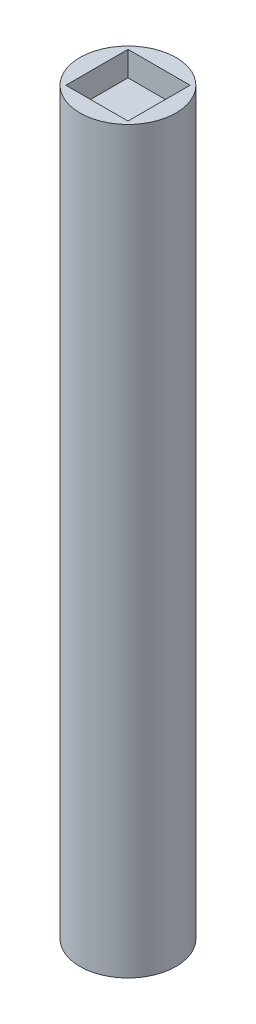
ISO-10303-21;
HEADER;
FILE_DESCRIPTION(('STEP AP214'),'2;1');
FILE_NAME('part.step','',(''),(''),'','','');
FILE_SCHEMA(('AUTOMOTIVE_DESIGN { 1 0 10303 214 1 1 1 1 }'));
ENDSEC;
DATA;
#1=APPLICATION_CONTEXT('core data for automotive mechanical design processes');
#2=APPLICATION_PROTOCOL_DEFINITION('international standard','automotive_design',2000,#1);
#3=PRODUCT_CONTEXT('',#1,'mechanical');
#4=PRODUCT('Part','Part','',(#3));
#5=PRODUCT_RELATED_PRODUCT_CATEGORY('part','',(#4));
#6=PRODUCT_DEFINITION_FORMATION('','',#4);
#7=PRODUCT_DEFINITION_CONTEXT('part definition',#1,'design');
#8=PRODUCT_DEFINITION('design','',#6,#7);
#9=PRODUCT_DEFINITION_SHAPE('','',#8);
#10=(LENGTH_UNIT() NAMED_UNIT(*) SI_UNIT(.MILLI.,.METRE.));
#11=(NAMED_UNIT(*) PLANE_ANGLE_UNIT() SI_UNIT($,.RADIAN.));
#12=(NAMED_UNIT(*) SI_UNIT($,.STERADIAN.) SOLID_ANGLE_UNIT());
#13=UNCERTAINTY_MEASURE_WITH_UNIT(LENGTH_MEASURE(1.E-05),#10,'distance_accuracy_value','');
#14=(GEOMETRIC_REPRESENTATION_CONTEXT(3) GLOBAL_UNCERTAINTY_ASSIGNED_CONTEXT((#13)) GLOBAL_UNIT_ASSIGNED_CONTEXT((#10,
#11,#12)) REPRESENTATION_CONTEXT('',''));
#15=CARTESIAN_POINT('',(0.,0.,0.));
#16=DIRECTION('',(0.,0.,1.));
#17=DIRECTION('',(1.,0.,0.));
#18=AXIS2_PLACEMENT_3D('',#15,#16,#17);
#19=CARTESIAN_POINT('',(0.,37.5,0.));
#20=DIRECTION('',(0.,-1.,0.));
#21=DIRECTION('',(0.,0.,-1.));
#22=AXIS2_PLACEMENT_3D('',#19,#20,#21);
#23=CYLINDRICAL_SURFACE('',#22,4.875);
#24=CARTESIAN_POINT('',(0.,37.5,0.));
#25=DIRECTION('',(0.,1.,0.));
#26=DIRECTION('',(0.,0.,1.));
#27=AXIS2_PLACEMENT_3D('',#24,#25,#26);
#28=CIRCLE('',#27,4.875);
#29=CARTESIAN_POINT('',(0.,37.5,4.875));
#30=VERTEX_POINT('',#29);
#31=EDGE_CURVE('E11',#30,#30,#28,.T.);
#32=ORIENTED_EDGE('',*,*,#31,.F.);
#33=EDGE_LOOP('',(#32));
#34=FACE_BOUND('',#33,.T.);
#35=CARTESIAN_POINT('',(0.,-37.5,0.));
#36=DIRECTION('',(0.,1.,0.));
#37=DIRECTION('',(0.,0.,1.));
#38=AXIS2_PLACEMENT_3D('',#35,#36,#37);
#39=CIRCLE('',#38,4.875);
#40=CARTESIAN_POINT('',(0.,-37.5,4.875));
#41=VERTEX_POINT('',#40);
#42=EDGE_CURVE('E42',#41,#41,#39,.T.);
#43=ORIENTED_EDGE('',*,*,#42,.T.);
#44=EDGE_LOOP('',(#43));
#45=FACE_BOUND('',#44,.T.);
#46=ADVANCED_FACE('F39',(#34,#45),#23,.T.);
#47=CARTESIAN_POINT('',(0.,37.5,0.));
#48=DIRECTION('',(0.,1.,0.));
#49=DIRECTION('',(0.,0.,1.));
#50=AXIS2_PLACEMENT_3D('',#47,#48,#49);
#51=PLANE('',#50);
#52=DIRECTION('',(0.,0.,1.));
#53=VECTOR('',#52,1.);
#54=CARTESIAN_POINT('',(-3.15,37.5,3.15));
#55=LINE('',#54,#53);
#56=CARTESIAN_POINT('',(-3.15,37.5,-3.15));
#57=VERTEX_POINT('',#56);
#58=CARTESIAN_POINT('',(-3.15,37.5,3.15));
#59=VERTEX_POINT('',#58);
#60=EDGE_CURVE('E106',#57,#59,#55,.T.);
#61=ORIENTED_EDGE('',*,*,#60,.F.);
#62=DIRECTION('',(-1.,0.,0.));
#63=VECTOR('',#62,1.);
#64=CARTESIAN_POINT('',(-3.15,37.5,-3.15));
#65=LINE('',#64,#63);
#66=CARTESIAN_POINT('',(3.15,37.5,-3.15));
#67=VERTEX_POINT('',#66);
#68=EDGE_CURVE('E84',#67,#57,#65,.T.);
#69=ORIENTED_EDGE('',*,*,#68,.F.);
#70=DIRECTION('',(0.,0.,-1.));
#71=VECTOR('',#70,1.);
#72=CARTESIAN_POINT('',(3.15,37.5,3.15));
#73=LINE('',#72,#71);
#74=CARTESIAN_POINT('',(3.15,37.5,3.15));
#75=VERTEX_POINT('',#74);
#76=EDGE_CURVE('E61',#75,#67,#73,.T.);
#77=ORIENTED_EDGE('',*,*,#76,.F.);
#78=DIRECTION('',(1.,0.,0.));
#79=VECTOR('',#78,1.);
#80=CARTESIAN_POINT('',(-3.15,37.5,3.15));
#81=LINE('',#80,#79);
#82=EDGE_CURVE('E111',#59,#75,#81,.T.);
#83=ORIENTED_EDGE('',*,*,#82,.F.);
#84=EDGE_LOOP('',(#61,#69,#77,#83));
#85=FACE_BOUND('',#84,.T.);
#86=ORIENTED_EDGE('',*,*,#31,.T.);
#87=EDGE_LOOP('',(#86));
#88=FACE_BOUND('',#87,.T.);
#89=ADVANCED_FACE('F120',(#85,#88),#51,.T.);
#90=CARTESIAN_POINT('',(0.,-37.5,0.));
#91=DIRECTION('',(0.,1.,0.));
#92=DIRECTION('',(0.,0.,1.));
#93=AXIS2_PLACEMENT_3D('',#90,#91,#92);
#94=PLANE('',#93);
#95=ORIENTED_EDGE('',*,*,#42,.F.);
#96=EDGE_LOOP('',(#95));
#97=FACE_BOUND('',#96,.T.);
#98=ADVANCED_FACE('F118',(#97),#94,.F.);
#99=CARTESIAN_POINT('',(3.15,35.,-3.15));
#100=DIRECTION('',(0.,0.,-1.));
#101=DIRECTION('',(-1.,0.,0.));
#102=AXIS2_PLACEMENT_3D('',#99,#100,#101);
#103=PLANE('',#102);
#104=ORIENTED_EDGE('',*,*,#68,.T.);
#105=DIRECTION('',(0.,1.,0.));
#106=VECTOR('',#105,1.);
#107=CARTESIAN_POINT('',(-3.15,35.,-3.15));
#108=LINE('',#107,#106);
#109=CARTESIAN_POINT('',(-3.15,35.,-3.15));
#110=VERTEX_POINT('',#109);
#111=EDGE_CURVE('E53',#110,#57,#108,.T.);
#112=ORIENTED_EDGE('',*,*,#111,.F.);
#113=DIRECTION('',(-1.,0.,0.));
#114=VECTOR('',#113,1.);
#115=CARTESIAN_POINT('',(3.15,35.,-3.15));
#116=LINE('',#115,#114);
#117=CARTESIAN_POINT('',(3.15,35.,-3.15));
#118=VERTEX_POINT('',#117);
#119=EDGE_CURVE('E81',#118,#110,#116,.T.);
#120=ORIENTED_EDGE('',*,*,#119,.F.);
#121=DIRECTION('',(0.,1.,0.));
#122=VECTOR('',#121,1.);
#123=CARTESIAN_POINT('',(3.15,35.,-3.15));
#124=LINE('',#123,#122);
#125=EDGE_CURVE('E104',#118,#67,#124,.T.);
#126=ORIENTED_EDGE('',*,*,#125,.T.);
#127=EDGE_LOOP('',(#104,#112,#120,#126));
#128=FACE_BOUND('',#127,.T.);
#129=ADVANCED_FACE('F79',(#128),#103,.F.);
#130=CARTESIAN_POINT('',(3.15,35.,3.15));
#131=DIRECTION('',(1.,0.,0.));
#132=DIRECTION('',(0.,0.,-1.));
#133=AXIS2_PLACEMENT_3D('',#130,#131,#132);
#134=PLANE('',#133);
#135=ORIENTED_EDGE('',*,*,#76,.T.);
#136=ORIENTED_EDGE('',*,*,#125,.F.);
#137=DIRECTION('',(0.,0.,-1.));
#138=VECTOR('',#137,1.);
#139=CARTESIAN_POINT('',(3.15,35.,3.15));
#140=LINE('',#139,#138);
#141=CARTESIAN_POINT('',(3.15,35.,3.15));
#142=VERTEX_POINT('',#141);
#143=EDGE_CURVE('E87',#142,#118,#140,.T.);
#144=ORIENTED_EDGE('',*,*,#143,.F.);
#145=DIRECTION('',(0.,1.,0.));
#146=VECTOR('',#145,1.);
#147=CARTESIAN_POINT('',(3.15,35.,3.15));
#148=LINE('',#147,#146);
#149=EDGE_CURVE('E107',#142,#75,#148,.T.);
#150=ORIENTED_EDGE('',*,*,#149,.T.);
#151=EDGE_LOOP('',(#135,#136,#144,#150));
#152=FACE_BOUND('',#151,.T.);
#153=ADVANCED_FACE('F126',(#152),#134,.F.);
#154=CARTESIAN_POINT('',(-3.15,35.,3.15));
#155=DIRECTION('',(0.,0.,1.));
#156=DIRECTION('',(1.,0.,0.));
#157=AXIS2_PLACEMENT_3D('',#154,#155,#156);
#158=PLANE('',#157);
#159=ORIENTED_EDGE('',*,*,#82,.T.);
#160=ORIENTED_EDGE('',*,*,#149,.F.);
#161=DIRECTION('',(1.,0.,0.));
#162=VECTOR('',#161,1.);
#163=CARTESIAN_POINT('',(-3.15,35.,3.15));
#164=LINE('',#163,#162);
#165=CARTESIAN_POINT('',(-3.15,35.,3.15));
#166=VERTEX_POINT('',#165);
#167=EDGE_CURVE('E96',#166,#142,#164,.T.);
#168=ORIENTED_EDGE('',*,*,#167,.F.);
#169=DIRECTION('',(0.,1.,0.));
#170=VECTOR('',#169,1.);
#171=CARTESIAN_POINT('',(-3.15,35.,3.15));
#172=LINE('',#171,#170);
#173=EDGE_CURVE('E86',#166,#59,#172,.T.);
#174=ORIENTED_EDGE('',*,*,#173,.T.);
#175=EDGE_LOOP('',(#159,#160,#168,#174));
#176=FACE_BOUND('',#175,.T.);
#177=ADVANCED_FACE('F161',(#176),#158,.F.);
#178=CARTESIAN_POINT('',(-3.15,35.,-3.15));
#179=DIRECTION('',(-1.,0.,0.));
#180=DIRECTION('',(0.,0.,1.));
#181=AXIS2_PLACEMENT_3D('',#178,#179,#180);
#182=PLANE('',#181);
#183=ORIENTED_EDGE('',*,*,#60,.T.);
#184=ORIENTED_EDGE('',*,*,#173,.F.);
#185=DIRECTION('',(0.,0.,1.));
#186=VECTOR('',#185,1.);
#187=CARTESIAN_POINT('',(-3.15,35.,-3.15));
#188=LINE('',#187,#186);
#189=EDGE_CURVE('E90',#110,#166,#188,.T.);
#190=ORIENTED_EDGE('',*,*,#189,.F.);
#191=ORIENTED_EDGE('',*,*,#111,.T.);
#192=EDGE_LOOP('',(#183,#184,#190,#191));
#193=FACE_BOUND('',#192,.T.);
#194=ADVANCED_FACE('F91',(#193),#182,.F.);
#195=CARTESIAN_POINT('',(0.,35.,0.));
#196=DIRECTION('',(0.,1.,0.));
#197=DIRECTION('',(0.,0.,1.));
#198=AXIS2_PLACEMENT_3D('',#195,#196,#197);
#199=PLANE('',#198);
#200=ORIENTED_EDGE('',*,*,#119,.T.);
#201=ORIENTED_EDGE('',*,*,#189,.T.);
#202=ORIENTED_EDGE('',*,*,#167,.T.);
#203=ORIENTED_EDGE('',*,*,#143,.T.);
#204=EDGE_LOOP('',(#200,#201,#202,#203));
#205=FACE_BOUND('',#204,.T.);
#206=ADVANCED_FACE('F98',(#205),#199,.T.);
#207=CLOSED_SHELL('',(#46,#89,#98,#129,#153,#177,#194,#206));
#208=MANIFOLD_SOLID_BREP('B2',#207);
#209=ADVANCED_BREP_SHAPE_REPRESENTATION('',(#18,#208),#14);
#210=SHAPE_DEFINITION_REPRESENTATION(#9,#209);
ENDSEC;
END-ISO-10303-21;
